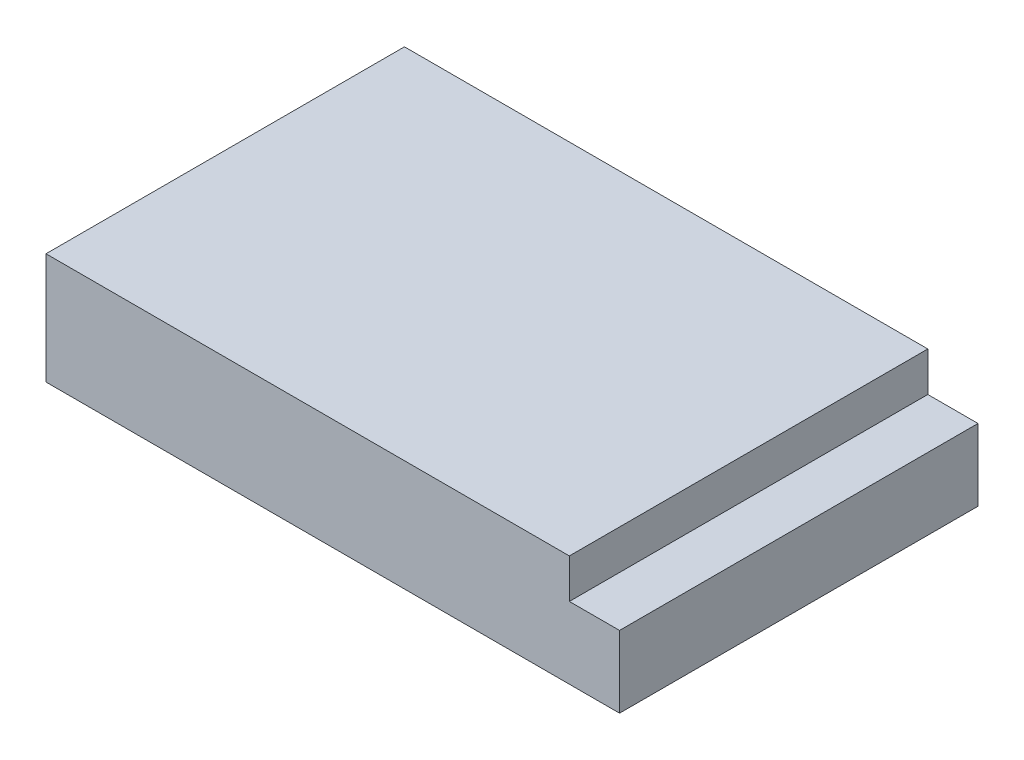
ISO-10303-21;
HEADER;
FILE_DESCRIPTION(('STEP AP214'),'2;1');
FILE_NAME('part.step','',(''),(''),'','','');
FILE_SCHEMA(('AUTOMOTIVE_DESIGN { 1 0 10303 214 1 1 1 1 }'));
ENDSEC;
DATA;
#1=APPLICATION_CONTEXT('core data for automotive mechanical design processes');
#2=APPLICATION_PROTOCOL_DEFINITION('international standard','automotive_design',2000,#1);
#3=PRODUCT_CONTEXT('',#1,'mechanical');
#4=PRODUCT('Part','Part','',(#3));
#5=PRODUCT_RELATED_PRODUCT_CATEGORY('part','',(#4));
#6=PRODUCT_DEFINITION_FORMATION('','',#4);
#7=PRODUCT_DEFINITION_CONTEXT('part definition',#1,'design');
#8=PRODUCT_DEFINITION('design','',#6,#7);
#9=PRODUCT_DEFINITION_SHAPE('','',#8);
#10=(LENGTH_UNIT() NAMED_UNIT(*) SI_UNIT(.MILLI.,.METRE.));
#11=(NAMED_UNIT(*) PLANE_ANGLE_UNIT() SI_UNIT($,.RADIAN.));
#12=(NAMED_UNIT(*) SI_UNIT($,.STERADIAN.) SOLID_ANGLE_UNIT());
#13=UNCERTAINTY_MEASURE_WITH_UNIT(LENGTH_MEASURE(1.E-05),#10,'distance_accuracy_value','');
#14=(GEOMETRIC_REPRESENTATION_CONTEXT(3) GLOBAL_UNCERTAINTY_ASSIGNED_CONTEXT((#13)) GLOBAL_UNIT_ASSIGNED_CONTEXT((#10,
#11,#12)) REPRESENTATION_CONTEXT('',''));
#15=CARTESIAN_POINT('',(0.,0.,0.));
#16=DIRECTION('',(0.,0.,1.));
#17=DIRECTION('',(1.,0.,0.));
#18=AXIS2_PLACEMENT_3D('',#15,#16,#17);
#19=CARTESIAN_POINT('',(-47.8512820512821,11.,100.));
#20=DIRECTION('',(1.,0.,0.));
#21=DIRECTION('',(0.,0.,-1.));
#22=AXIS2_PLACEMENT_3D('',#19,#20,#21);
#23=PLANE('',#22);
#24=DIRECTION('',(0.,-1.,0.));
#25=VECTOR('',#24,1.);
#26=CARTESIAN_POINT('',(-47.8512820512821,11.,0.));
#27=LINE('',#26,#25);
#28=CARTESIAN_POINT('',(-47.8512820512821,11.,0.));
#29=VERTEX_POINT('',#28);
#30=CARTESIAN_POINT('',(-47.8512820512821,-20.,0.));
#31=VERTEX_POINT('',#30);
#32=EDGE_CURVE('E122',#29,#31,#27,.T.);
#33=ORIENTED_EDGE('',*,*,#32,.T.);
#34=DIRECTION('',(0.,0.,-1.));
#35=VECTOR('',#34,1.);
#36=CARTESIAN_POINT('',(-47.8512820512821,-20.,100.));
#37=LINE('',#36,#35);
#38=CARTESIAN_POINT('',(-47.8512820512821,-20.,100.));
#39=VERTEX_POINT('',#38);
#40=EDGE_CURVE('E11',#39,#31,#37,.T.);
#41=ORIENTED_EDGE('',*,*,#40,.F.);
#42=DIRECTION('',(0.,-1.,0.));
#43=VECTOR('',#42,1.);
#44=CARTESIAN_POINT('',(-47.8512820512821,11.,100.));
#45=LINE('',#44,#43);
#46=CARTESIAN_POINT('',(-47.8512820512821,11.,100.));
#47=VERTEX_POINT('',#46);
#48=EDGE_CURVE('E132',#47,#39,#45,.T.);
#49=ORIENTED_EDGE('',*,*,#48,.F.);
#50=DIRECTION('',(0.,0.,-1.));
#51=VECTOR('',#50,1.);
#52=CARTESIAN_POINT('',(-47.8512820512821,11.,100.));
#53=LINE('',#52,#51);
#54=EDGE_CURVE('E118',#47,#29,#53,.T.);
#55=ORIENTED_EDGE('',*,*,#54,.T.);
#56=EDGE_LOOP('',(#33,#41,#49,#55));
#57=FACE_BOUND('',#56,.T.);
#58=ADVANCED_FACE('F38',(#57),#23,.F.);
#59=CARTESIAN_POINT('',(-47.8512820512821,-20.,100.));
#60=DIRECTION('',(0.,1.,0.));
#61=DIRECTION('',(-1.,0.,0.));
#62=AXIS2_PLACEMENT_3D('',#59,#60,#61);
#63=PLANE('',#62);
#64=DIRECTION('',(1.,0.,0.));
#65=VECTOR('',#64,1.);
#66=CARTESIAN_POINT('',(-47.8512820512821,-20.,0.));
#67=LINE('',#66,#65);
#68=CARTESIAN_POINT('',(112.148717948718,-20.,0.));
#69=VERTEX_POINT('',#68);
#70=EDGE_CURVE('E125',#31,#69,#67,.T.);
#71=ORIENTED_EDGE('',*,*,#70,.T.);
#72=DIRECTION('',(0.,0.,-1.));
#73=VECTOR('',#72,1.);
#74=CARTESIAN_POINT('',(112.148717948718,-20.,100.));
#75=LINE('',#74,#73);
#76=CARTESIAN_POINT('',(112.148717948718,-20.,100.));
#77=VERTEX_POINT('',#76);
#78=EDGE_CURVE('E46',#77,#69,#75,.T.);
#79=ORIENTED_EDGE('',*,*,#78,.F.);
#80=DIRECTION('',(1.,0.,0.));
#81=VECTOR('',#80,1.);
#82=CARTESIAN_POINT('',(-47.8512820512821,-20.,100.));
#83=LINE('',#82,#81);
#84=EDGE_CURVE('E91',#39,#77,#83,.T.);
#85=ORIENTED_EDGE('',*,*,#84,.F.);
#86=ORIENTED_EDGE('',*,*,#40,.T.);
#87=EDGE_LOOP('',(#71,#79,#85,#86));
#88=FACE_BOUND('',#87,.T.);
#89=ADVANCED_FACE('F156',(#88),#63,.F.);
#90=CARTESIAN_POINT('',(112.148717948718,0.,100.));
#91=DIRECTION('',(-1.,0.,0.));
#92=DIRECTION('',(0.,-1.,0.));
#93=AXIS2_PLACEMENT_3D('',#90,#91,#92);
#94=PLANE('',#93);
#95=DIRECTION('',(0.,1.,0.));
#96=VECTOR('',#95,1.);
#97=CARTESIAN_POINT('',(112.148717948718,0.,0.));
#98=LINE('',#97,#96);
#99=CARTESIAN_POINT('',(112.148717948718,0.,0.));
#100=VERTEX_POINT('',#99);
#101=EDGE_CURVE('E127',#69,#100,#98,.T.);
#102=ORIENTED_EDGE('',*,*,#101,.T.);
#103=DIRECTION('',(0.,0.,-1.));
#104=VECTOR('',#103,1.);
#105=CARTESIAN_POINT('',(112.148717948718,0.,100.));
#106=LINE('',#105,#104);
#107=CARTESIAN_POINT('',(112.148717948718,0.,100.));
#108=VERTEX_POINT('',#107);
#109=EDGE_CURVE('E113',#108,#100,#106,.T.);
#110=ORIENTED_EDGE('',*,*,#109,.F.);
#111=DIRECTION('',(0.,1.,0.));
#112=VECTOR('',#111,1.);
#113=CARTESIAN_POINT('',(112.148717948718,0.,100.));
#114=LINE('',#113,#112);
#115=EDGE_CURVE('E104',#77,#108,#114,.T.);
#116=ORIENTED_EDGE('',*,*,#115,.F.);
#117=ORIENTED_EDGE('',*,*,#78,.T.);
#118=EDGE_LOOP('',(#102,#110,#116,#117));
#119=FACE_BOUND('',#118,.T.);
#120=ADVANCED_FACE('F138',(#119),#94,.F.);
#121=CARTESIAN_POINT('',(98.1487179487179,0.,100.));
#122=DIRECTION('',(0.,-1.,0.));
#123=DIRECTION('',(0.,0.,-1.));
#124=AXIS2_PLACEMENT_3D('',#121,#122,#123);
#125=PLANE('',#124);
#126=DIRECTION('',(-1.,0.,0.));
#127=VECTOR('',#126,1.);
#128=CARTESIAN_POINT('',(98.1487179487179,0.,0.));
#129=LINE('',#128,#127);
#130=CARTESIAN_POINT('',(98.1487179487179,0.,0.));
#131=VERTEX_POINT('',#130);
#132=EDGE_CURVE('E112',#100,#131,#129,.T.);
#133=ORIENTED_EDGE('',*,*,#132,.T.);
#134=DIRECTION('',(0.,0.,-1.));
#135=VECTOR('',#134,1.);
#136=CARTESIAN_POINT('',(98.1487179487179,0.,100.));
#137=LINE('',#136,#135);
#138=CARTESIAN_POINT('',(98.1487179487179,0.,100.));
#139=VERTEX_POINT('',#138);
#140=EDGE_CURVE('E109',#139,#131,#137,.T.);
#141=ORIENTED_EDGE('',*,*,#140,.F.);
#142=DIRECTION('',(-1.,0.,0.));
#143=VECTOR('',#142,1.);
#144=CARTESIAN_POINT('',(98.1487179487179,0.,100.));
#145=LINE('',#144,#143);
#146=EDGE_CURVE('E98',#108,#139,#145,.T.);
#147=ORIENTED_EDGE('',*,*,#146,.F.);
#148=ORIENTED_EDGE('',*,*,#109,.T.);
#149=EDGE_LOOP('',(#133,#141,#147,#148));
#150=FACE_BOUND('',#149,.T.);
#151=ADVANCED_FACE('F110',(#150),#125,.F.);
#152=CARTESIAN_POINT('',(98.1487179487179,11.,100.));
#153=DIRECTION('',(-1.,0.,0.));
#154=DIRECTION('',(0.,0.,1.));
#155=AXIS2_PLACEMENT_3D('',#152,#153,#154);
#156=PLANE('',#155);
#157=DIRECTION('',(0.,1.,0.));
#158=VECTOR('',#157,1.);
#159=CARTESIAN_POINT('',(98.1487179487179,11.,0.));
#160=LINE('',#159,#158);
#161=CARTESIAN_POINT('',(98.1487179487179,11.,0.));
#162=VERTEX_POINT('',#161);
#163=EDGE_CURVE('E77',#131,#162,#160,.T.);
#164=ORIENTED_EDGE('',*,*,#163,.T.);
#165=DIRECTION('',(0.,0.,-1.));
#166=VECTOR('',#165,1.);
#167=CARTESIAN_POINT('',(98.1487179487179,11.,100.));
#168=LINE('',#167,#166);
#169=CARTESIAN_POINT('',(98.1487179487179,11.,100.));
#170=VERTEX_POINT('',#169);
#171=EDGE_CURVE('E114',#170,#162,#168,.T.);
#172=ORIENTED_EDGE('',*,*,#171,.F.);
#173=DIRECTION('',(0.,1.,0.));
#174=VECTOR('',#173,1.);
#175=CARTESIAN_POINT('',(98.1487179487179,11.,100.));
#176=LINE('',#175,#174);
#177=EDGE_CURVE('E102',#139,#170,#176,.T.);
#178=ORIENTED_EDGE('',*,*,#177,.F.);
#179=ORIENTED_EDGE('',*,*,#140,.T.);
#180=EDGE_LOOP('',(#164,#172,#178,#179));
#181=FACE_BOUND('',#180,.T.);
#182=ADVANCED_FACE('F116',(#181),#156,.F.);
#183=CARTESIAN_POINT('',(-47.8512820512821,11.,100.));
#184=DIRECTION('',(0.,-1.,0.));
#185=DIRECTION('',(1.,0.,0.));
#186=AXIS2_PLACEMENT_3D('',#183,#184,#185);
#187=PLANE('',#186);
#188=DIRECTION('',(-1.,0.,0.));
#189=VECTOR('',#188,1.);
#190=CARTESIAN_POINT('',(-47.8512820512821,11.,0.));
#191=LINE('',#190,#189);
#192=EDGE_CURVE('E83',#162,#29,#191,.T.);
#193=ORIENTED_EDGE('',*,*,#192,.T.);
#194=ORIENTED_EDGE('',*,*,#54,.F.);
#195=DIRECTION('',(-1.,0.,0.));
#196=VECTOR('',#195,1.);
#197=CARTESIAN_POINT('',(-47.8512820512821,11.,100.));
#198=LINE('',#197,#196);
#199=EDGE_CURVE('E54',#170,#47,#198,.T.);
#200=ORIENTED_EDGE('',*,*,#199,.F.);
#201=ORIENTED_EDGE('',*,*,#171,.T.);
#202=EDGE_LOOP('',(#193,#194,#200,#201));
#203=FACE_BOUND('',#202,.T.);
#204=ADVANCED_FACE('F145',(#203),#187,.F.);
#205=CARTESIAN_POINT('',(0.,0.,100.));
#206=DIRECTION('',(0.,0.,1.));
#207=DIRECTION('',(1.,0.,0.));
#208=AXIS2_PLACEMENT_3D('',#205,#206,#207);
#209=PLANE('',#208);
#210=ORIENTED_EDGE('',*,*,#48,.T.);
#211=ORIENTED_EDGE('',*,*,#84,.T.);
#212=ORIENTED_EDGE('',*,*,#115,.T.);
#213=ORIENTED_EDGE('',*,*,#146,.T.);
#214=ORIENTED_EDGE('',*,*,#177,.T.);
#215=ORIENTED_EDGE('',*,*,#199,.T.);
#216=EDGE_LOOP('',(#210,#211,#212,#213,#214,#215));
#217=FACE_BOUND('',#216,.T.);
#218=ADVANCED_FACE('F100',(#217),#209,.T.);
#219=CARTESIAN_POINT('',(0.,0.,0.));
#220=DIRECTION('',(0.,0.,1.));
#221=DIRECTION('',(1.,0.,0.));
#222=AXIS2_PLACEMENT_3D('',#219,#220,#221);
#223=PLANE('',#222);
#224=ORIENTED_EDGE('',*,*,#32,.F.);
#225=ORIENTED_EDGE('',*,*,#192,.F.);
#226=ORIENTED_EDGE('',*,*,#163,.F.);
#227=ORIENTED_EDGE('',*,*,#132,.F.);
#228=ORIENTED_EDGE('',*,*,#101,.F.);
#229=ORIENTED_EDGE('',*,*,#70,.F.);
#230=EDGE_LOOP('',(#224,#225,#226,#227,#228,#229));
#231=FACE_BOUND('',#230,.T.);
#232=ADVANCED_FACE('F141',(#231),#223,.F.);
#233=CLOSED_SHELL('',(#58,#89,#120,#151,#182,#204,#218,#232));
#234=MANIFOLD_SOLID_BREP('B2',#233);
#235=ADVANCED_BREP_SHAPE_REPRESENTATION('',(#18,#234),#14);
#236=SHAPE_DEFINITION_REPRESENTATION(#9,#235);
ENDSEC;
END-ISO-10303-21;
